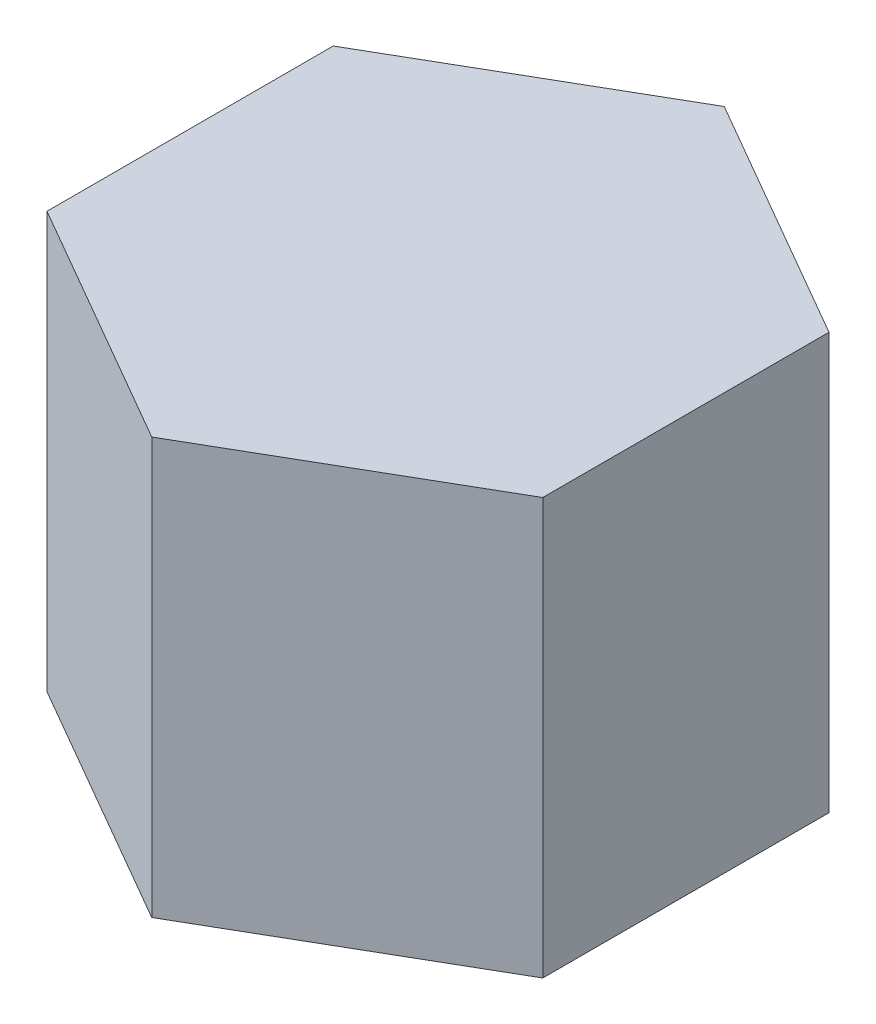
ISO-10303-21;
HEADER;
FILE_DESCRIPTION(('STEP AP214'),'2;1');
FILE_NAME('part.step','',(''),(''),'','','');
FILE_SCHEMA(('AUTOMOTIVE_DESIGN { 1 0 10303 214 1 1 1 1 }'));
ENDSEC;
DATA;
#1=APPLICATION_CONTEXT('core data for automotive mechanical design processes');
#2=APPLICATION_PROTOCOL_DEFINITION('international standard','automotive_design',2000,#1);
#3=PRODUCT_CONTEXT('',#1,'mechanical');
#4=PRODUCT('Part','Part','',(#3));
#5=PRODUCT_RELATED_PRODUCT_CATEGORY('part','',(#4));
#6=PRODUCT_DEFINITION_FORMATION('','',#4);
#7=PRODUCT_DEFINITION_CONTEXT('part definition',#1,'design');
#8=PRODUCT_DEFINITION('design','',#6,#7);
#9=PRODUCT_DEFINITION_SHAPE('','',#8);
#10=(LENGTH_UNIT() NAMED_UNIT(*) SI_UNIT(.MILLI.,.METRE.));
#11=(NAMED_UNIT(*) PLANE_ANGLE_UNIT() SI_UNIT($,.RADIAN.));
#12=(NAMED_UNIT(*) SI_UNIT($,.STERADIAN.) SOLID_ANGLE_UNIT());
#13=UNCERTAINTY_MEASURE_WITH_UNIT(LENGTH_MEASURE(1.E-05),#10,'distance_accuracy_value','');
#14=(GEOMETRIC_REPRESENTATION_CONTEXT(3) GLOBAL_UNCERTAINTY_ASSIGNED_CONTEXT((#13)) GLOBAL_UNIT_ASSIGNED_CONTEXT((#10,
#11,#12)) REPRESENTATION_CONTEXT('',''));
#15=CARTESIAN_POINT('',(0.,0.,0.));
#16=DIRECTION('',(0.,0.,1.));
#17=DIRECTION('',(1.,0.,0.));
#18=AXIS2_PLACEMENT_3D('',#15,#16,#17);
#19=CARTESIAN_POINT('',(204.339551417382,-147.556598747966,289.949920412926));
#20=DIRECTION('',(-0.499999999999943,0.,-0.866025403784471));
#21=DIRECTION('',(-0.866025403784471,0.,0.499999999999943));
#22=AXIS2_PLACEMENT_3D('',#19,#20,#21);
#23=PLANE('',#22);
#24=CARTESIAN_POINT('',(204.642660308706,-147.047793579175,289.774920412926));
#25=DIRECTION('',(-0.866025403784471,0.,0.499999999999943));
#26=VECTOR('',#25,1.);
#27=LINE('',#24,#26);
#28=CARTESIAN_POINT('',(204.642660308706,-147.047793579175,289.774920412926));
#29=VERTEX_POINT('',#28);
#30=CARTESIAN_POINT('',(204.339551417382,-147.047793579175,289.949920412926));
#31=VERTEX_POINT('',#30);
#32=EDGE_CURVE('E170',#29,#31,#27,.T.);
#33=ORIENTED_EDGE('',*,*,#32,.T.);
#34=CARTESIAN_POINT('',(204.339551417382,-147.556598747966,289.949920412926));
#35=DIRECTION('',(0.,1.,0.));
#36=VECTOR('',#35,1.);
#37=LINE('',#34,#36);
#38=CARTESIAN_POINT('',(204.339551417382,-147.556598747966,289.949920412926));
#39=VERTEX_POINT('',#38);
#40=EDGE_CURVE('E35',#39,#31,#37,.T.);
#41=ORIENTED_EDGE('',*,*,#40,.F.);
#42=CARTESIAN_POINT('',(204.642660308706,-147.556598747966,289.774920412926));
#43=DIRECTION('',(-0.866025403784471,0.,0.499999999999943));
#44=VECTOR('',#43,1.);
#45=LINE('',#42,#44);
#46=CARTESIAN_POINT('',(204.642660308706,-147.556598747966,289.774920412926));
#47=VERTEX_POINT('',#46);
#48=EDGE_CURVE('E159',#47,#39,#45,.T.);
#49=ORIENTED_EDGE('',*,*,#48,.F.);
#50=CARTESIAN_POINT('',(204.642660308706,-147.556598747966,289.774920412926));
#51=DIRECTION('',(0.,1.,0.));
#52=VECTOR('',#51,1.);
#53=LINE('',#50,#52);
#54=EDGE_CURVE('E10',#47,#29,#53,.T.);
#55=ORIENTED_EDGE('',*,*,#54,.T.);
#56=EDGE_LOOP('',(#33,#41,#49,#55));
#57=FACE_BOUND('',#56,.T.);
#58=ADVANCED_FACE('F16',(#57),#23,.F.);
#59=CARTESIAN_POINT('',(204.642660308706,-147.556598747966,291.594471220494));
#60=DIRECTION('',(-1.,0.,0.));
#61=DIRECTION('',(0.,-1.,0.));
#62=AXIS2_PLACEMENT_3D('',#59,#60,#61);
#63=PLANE('',#62);
#64=CARTESIAN_POINT('',(204.642660308706,-147.047793579175,289.424920412926));
#65=DIRECTION('',(0.,0.,1.));
#66=VECTOR('',#65,1.);
#67=LINE('',#64,#66);
#68=CARTESIAN_POINT('',(204.642660308706,-147.047793579175,289.424920412926));
#69=VERTEX_POINT('',#68);
#70=EDGE_CURVE('E167',#69,#29,#67,.T.);
#71=ORIENTED_EDGE('',*,*,#70,.T.);
#72=ORIENTED_EDGE('',*,*,#54,.F.);
#73=CARTESIAN_POINT('',(204.642660308706,-147.556598747966,289.424920412926));
#74=DIRECTION('',(0.,0.,1.));
#75=VECTOR('',#74,1.);
#76=LINE('',#73,#75);
#77=CARTESIAN_POINT('',(204.642660308706,-147.556598747966,289.424920412926));
#78=VERTEX_POINT('',#77);
#79=EDGE_CURVE('E156',#78,#47,#76,.T.);
#80=ORIENTED_EDGE('',*,*,#79,.F.);
#81=CARTESIAN_POINT('',(204.642660308706,-147.556598747966,289.424920412926));
#82=DIRECTION('',(0.,1.,0.));
#83=VECTOR('',#82,1.);
#84=LINE('',#81,#83);
#85=EDGE_CURVE('E27',#78,#69,#84,.T.);
#86=ORIENTED_EDGE('',*,*,#85,.T.);
#87=EDGE_LOOP('',(#71,#72,#80,#86));
#88=FACE_BOUND('',#87,.T.);
#89=ADVANCED_FACE('F189',(#88),#63,.F.);
#90=CARTESIAN_POINT('',(204.642660308706,-147.556598747966,289.424920412926));
#91=DIRECTION('',(-0.499999999999978,0.,0.866025403784452));
#92=DIRECTION('',(0.866025403784452,0.,0.499999999999978));
#93=AXIS2_PLACEMENT_3D('',#90,#91,#92);
#94=PLANE('',#93);
#95=CARTESIAN_POINT('',(204.339551417382,-147.047793579175,289.249920412926));
#96=DIRECTION('',(0.866025403784452,0.,0.499999999999978));
#97=VECTOR('',#96,1.);
#98=LINE('',#95,#97);
#99=CARTESIAN_POINT('',(204.339551417382,-147.047793579175,289.249920412926));
#100=VERTEX_POINT('',#99);
#101=EDGE_CURVE('E163',#100,#69,#98,.T.);
#102=ORIENTED_EDGE('',*,*,#101,.T.);
#103=ORIENTED_EDGE('',*,*,#85,.F.);
#104=CARTESIAN_POINT('',(204.339551417382,-147.556598747966,289.249920412926));
#105=DIRECTION('',(0.866025403784452,0.,0.499999999999978));
#106=VECTOR('',#105,1.);
#107=LINE('',#104,#106);
#108=CARTESIAN_POINT('',(204.339551417382,-147.556598747966,289.249920412926));
#109=VERTEX_POINT('',#108);
#110=EDGE_CURVE('E106',#109,#78,#107,.T.);
#111=ORIENTED_EDGE('',*,*,#110,.F.);
#112=CARTESIAN_POINT('',(204.339551417382,-147.556598747966,289.249920412926));
#113=DIRECTION('',(0.,1.,0.));
#114=VECTOR('',#113,1.);
#115=LINE('',#112,#114);
#116=EDGE_CURVE('E94',#109,#100,#115,.T.);
#117=ORIENTED_EDGE('',*,*,#116,.T.);
#118=EDGE_LOOP('',(#102,#103,#111,#117));
#119=FACE_BOUND('',#118,.T.);
#120=ADVANCED_FACE('F198',(#119),#94,.F.);
#121=CARTESIAN_POINT('',(204.339551417382,-147.556598747966,289.249920412926));
#122=DIRECTION('',(0.499999999999978,0.,0.866025403784452));
#123=DIRECTION('',(0.866025403784452,0.,-0.499999999999978));
#124=AXIS2_PLACEMENT_3D('',#121,#122,#123);
#125=PLANE('',#124);
#126=CARTESIAN_POINT('',(204.036442526057,-147.047793579175,289.424920412926));
#127=DIRECTION('',(0.866025403784452,0.,-0.499999999999978));
#128=VECTOR('',#127,1.);
#129=LINE('',#126,#128);
#130=CARTESIAN_POINT('',(204.036442526057,-147.047793579175,289.424920412926));
#131=VERTEX_POINT('',#130);
#132=EDGE_CURVE('E162',#131,#100,#129,.T.);
#133=ORIENTED_EDGE('',*,*,#132,.T.);
#134=ORIENTED_EDGE('',*,*,#116,.F.);
#135=CARTESIAN_POINT('',(204.036442526057,-147.556598747966,289.424920412926));
#136=DIRECTION('',(0.866025403784452,0.,-0.499999999999978));
#137=VECTOR('',#136,1.);
#138=LINE('',#135,#137);
#139=CARTESIAN_POINT('',(204.036442526057,-147.556598747966,289.424920412926));
#140=VERTEX_POINT('',#139);
#141=EDGE_CURVE('E98',#140,#109,#138,.T.);
#142=ORIENTED_EDGE('',*,*,#141,.F.);
#143=CARTESIAN_POINT('',(204.036442526057,-147.556598747966,289.424920412926));
#144=DIRECTION('',(0.,1.,0.));
#145=VECTOR('',#144,1.);
#146=LINE('',#143,#145);
#147=EDGE_CURVE('E79',#140,#131,#146,.T.);
#148=ORIENTED_EDGE('',*,*,#147,.T.);
#149=EDGE_LOOP('',(#133,#134,#142,#148));
#150=FACE_BOUND('',#149,.T.);
#151=ADVANCED_FACE('F100',(#150),#125,.F.);
#152=CARTESIAN_POINT('',(204.036442526057,-147.556598747966,291.594471220494));
#153=DIRECTION('',(1.,0.,0.));
#154=DIRECTION('',(0.,1.,0.));
#155=AXIS2_PLACEMENT_3D('',#152,#153,#154);
#156=PLANE('',#155);
#157=CARTESIAN_POINT('',(204.036442526057,-147.047793579175,289.774920412926));
#158=DIRECTION('',(0.,0.,-1.));
#159=VECTOR('',#158,1.);
#160=LINE('',#157,#159);
#161=CARTESIAN_POINT('',(204.036442526057,-147.047793579175,289.774920412926));
#162=VERTEX_POINT('',#161);
#163=EDGE_CURVE('E88',#162,#131,#160,.T.);
#164=ORIENTED_EDGE('',*,*,#163,.T.);
#165=ORIENTED_EDGE('',*,*,#147,.F.);
#166=CARTESIAN_POINT('',(204.036442526057,-147.556598747966,289.774920412926));
#167=DIRECTION('',(0.,0.,-1.));
#168=VECTOR('',#167,1.);
#169=LINE('',#166,#168);
#170=CARTESIAN_POINT('',(204.036442526057,-147.556598747966,289.774920412926));
#171=VERTEX_POINT('',#170);
#172=EDGE_CURVE('E84',#171,#140,#169,.T.);
#173=ORIENTED_EDGE('',*,*,#172,.F.);
#174=CARTESIAN_POINT('',(204.036442526057,-147.556598747966,289.774920412926));
#175=DIRECTION('',(0.,1.,0.));
#176=VECTOR('',#175,1.);
#177=LINE('',#174,#176);
#178=EDGE_CURVE('E58',#171,#162,#177,.T.);
#179=ORIENTED_EDGE('',*,*,#178,.T.);
#180=EDGE_LOOP('',(#164,#165,#173,#179));
#181=FACE_BOUND('',#180,.T.);
#182=ADVANCED_FACE('F82',(#181),#156,.F.);
#183=CARTESIAN_POINT('',(204.036442526057,-147.556598747966,289.774920412926));
#184=DIRECTION('',(0.499999999999943,0.,-0.866025403784471));
#185=DIRECTION('',(-0.866025403784471,0.,-0.499999999999943));
#186=AXIS2_PLACEMENT_3D('',#183,#184,#185);
#187=PLANE('',#186);
#188=CARTESIAN_POINT('',(204.339551417382,-147.047793579175,289.949920412926));
#189=DIRECTION('',(-0.866025403784471,0.,-0.499999999999943));
#190=VECTOR('',#189,1.);
#191=LINE('',#188,#190);
#192=EDGE_CURVE('E160',#31,#162,#191,.T.);
#193=ORIENTED_EDGE('',*,*,#192,.T.);
#194=ORIENTED_EDGE('',*,*,#178,.F.);
#195=CARTESIAN_POINT('',(204.339551417382,-147.556598747966,289.949920412926));
#196=DIRECTION('',(-0.866025403784471,0.,-0.499999999999943));
#197=VECTOR('',#196,1.);
#198=LINE('',#195,#197);
#199=EDGE_CURVE('E112',#39,#171,#198,.T.);
#200=ORIENTED_EDGE('',*,*,#199,.F.);
#201=ORIENTED_EDGE('',*,*,#40,.T.);
#202=EDGE_LOOP('',(#193,#194,#200,#201));
#203=FACE_BOUND('',#202,.T.);
#204=ADVANCED_FACE('F131',(#203),#187,.F.);
#205=CARTESIAN_POINT('',(206.491105863044,-147.556598747966,291.594471220494));
#206=DIRECTION('',(0.,1.,0.));
#207=DIRECTION('',(-1.,0.,0.));
#208=AXIS2_PLACEMENT_3D('',#205,#206,#207);
#209=PLANE('',#208);
#210=ORIENTED_EDGE('',*,*,#48,.T.);
#211=ORIENTED_EDGE('',*,*,#199,.T.);
#212=ORIENTED_EDGE('',*,*,#172,.T.);
#213=ORIENTED_EDGE('',*,*,#141,.T.);
#214=ORIENTED_EDGE('',*,*,#110,.T.);
#215=ORIENTED_EDGE('',*,*,#79,.T.);
#216=EDGE_LOOP('',(#210,#211,#212,#213,#214,#215));
#217=FACE_BOUND('',#216,.T.);
#218=ADVANCED_FACE('F111',(#217),#209,.F.);
#219=CARTESIAN_POINT('',(206.491105863044,-147.047793579175,291.594471220494));
#220=DIRECTION('',(0.,1.,0.));
#221=DIRECTION('',(-1.,0.,0.));
#222=AXIS2_PLACEMENT_3D('',#219,#220,#221);
#223=PLANE('',#222);
#224=ORIENTED_EDGE('',*,*,#32,.F.);
#225=ORIENTED_EDGE('',*,*,#70,.F.);
#226=ORIENTED_EDGE('',*,*,#101,.F.);
#227=ORIENTED_EDGE('',*,*,#132,.F.);
#228=ORIENTED_EDGE('',*,*,#163,.F.);
#229=ORIENTED_EDGE('',*,*,#192,.F.);
#230=EDGE_LOOP('',(#224,#225,#226,#227,#228,#229));
#231=FACE_BOUND('',#230,.T.);
#232=ADVANCED_FACE('F130',(#231),#223,.T.);
#233=CLOSED_SHELL('',(#58,#89,#120,#151,#182,#204,#218,#232));
#234=MANIFOLD_SOLID_BREP('B1',#233);
#235=ADVANCED_BREP_SHAPE_REPRESENTATION('',(#18,#234),#14);
#236=SHAPE_DEFINITION_REPRESENTATION(#9,#235);
ENDSEC;
END-ISO-10303-21;
